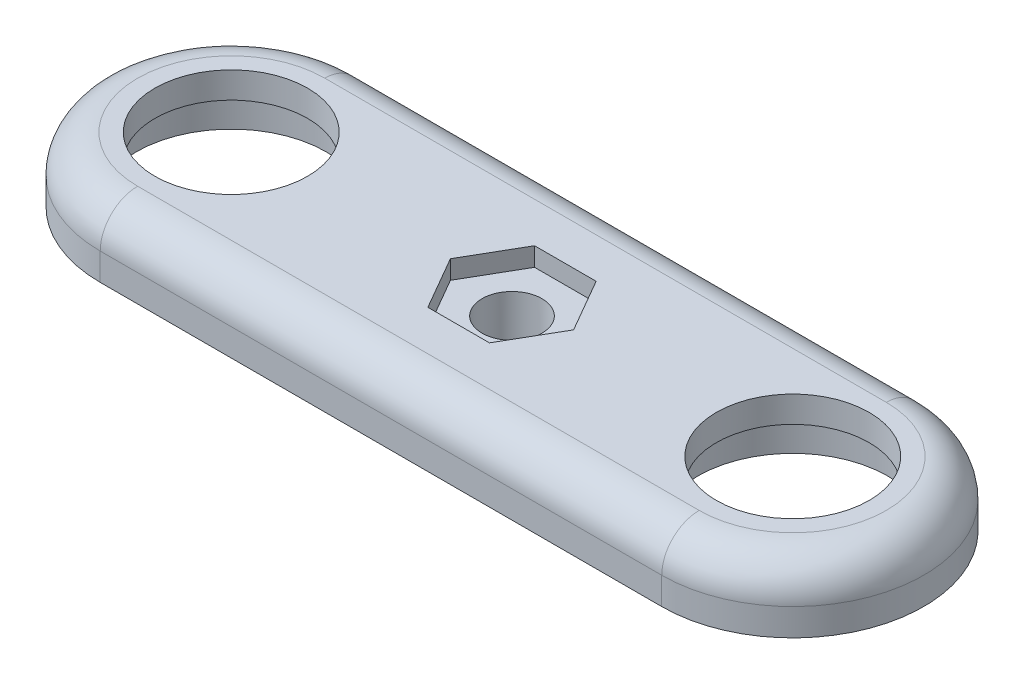
ISO-10303-21;
HEADER;
FILE_DESCRIPTION(('STEP AP214'),'2;1');
FILE_NAME('part.step','',(''),(''),'','','');
FILE_SCHEMA(('AUTOMOTIVE_DESIGN { 1 0 10303 214 1 1 1 1 }'));
ENDSEC;
DATA;
#1=APPLICATION_CONTEXT('core data for automotive mechanical design processes');
#2=APPLICATION_PROTOCOL_DEFINITION('international standard','automotive_design',2000,#1);
#3=PRODUCT_CONTEXT('',#1,'mechanical');
#4=PRODUCT('Part','Part','',(#3));
#5=PRODUCT_RELATED_PRODUCT_CATEGORY('part','',(#4));
#6=PRODUCT_DEFINITION_FORMATION('','',#4);
#7=PRODUCT_DEFINITION_CONTEXT('part definition',#1,'design');
#8=PRODUCT_DEFINITION('design','',#6,#7);
#9=PRODUCT_DEFINITION_SHAPE('','',#8);
#10=(LENGTH_UNIT() NAMED_UNIT(*) SI_UNIT(.MILLI.,.METRE.));
#11=(NAMED_UNIT(*) PLANE_ANGLE_UNIT() SI_UNIT($,.RADIAN.));
#12=(NAMED_UNIT(*) SI_UNIT($,.STERADIAN.) SOLID_ANGLE_UNIT());
#13=UNCERTAINTY_MEASURE_WITH_UNIT(LENGTH_MEASURE(1.E-05),#10,'distance_accuracy_value','');
#14=(GEOMETRIC_REPRESENTATION_CONTEXT(3) GLOBAL_UNCERTAINTY_ASSIGNED_CONTEXT((#13)) GLOBAL_UNIT_ASSIGNED_CONTEXT((#10,
#11,#12)) REPRESENTATION_CONTEXT('',''));
#15=CARTESIAN_POINT('',(0.,0.,0.));
#16=DIRECTION('',(0.,0.,1.));
#17=DIRECTION('',(1.,0.,0.));
#18=AXIS2_PLACEMENT_3D('',#15,#16,#17);
#19=CARTESIAN_POINT('',(-15.,3.45,0.));
#20=DIRECTION('',(0.,-1.,0.));
#21=DIRECTION('',(0.,0.,-1.));
#22=AXIS2_PLACEMENT_3D('',#19,#20,#21);
#23=CYLINDRICAL_SURFACE('',#22,4.08);
#24=CARTESIAN_POINT('',(-15.,3.45,0.));
#25=DIRECTION('',(0.,1.,0.));
#26=DIRECTION('',(0.,0.,1.));
#27=AXIS2_PLACEMENT_3D('',#24,#25,#26);
#28=CIRCLE('',#27,4.08);
#29=CARTESIAN_POINT('',(-15.,3.45,4.08));
#30=VERTEX_POINT('',#29);
#31=EDGE_CURVE('E168',#30,#30,#28,.T.);
#32=ORIENTED_EDGE('',*,*,#31,.T.);
#33=EDGE_LOOP('',(#32));
#34=FACE_BOUND('',#33,.T.);
#35=CARTESIAN_POINT('',(-15.,2.05,0.));
#36=DIRECTION('',(0.,-1.,0.));
#37=DIRECTION('',(0.,0.,-1.));
#38=AXIS2_PLACEMENT_3D('',#35,#36,#37);
#39=CIRCLE('',#38,4.08);
#40=CARTESIAN_POINT('',(-15.,2.05,-4.08));
#41=VERTEX_POINT('',#40);
#42=EDGE_CURVE('E195',#41,#41,#39,.T.);
#43=ORIENTED_EDGE('',*,*,#42,.T.);
#44=EDGE_LOOP('',(#43));
#45=FACE_BOUND('',#44,.T.);
#46=ADVANCED_FACE('F38',(#34,#45),#23,.F.);
#47=CARTESIAN_POINT('',(15.,3.45,0.));
#48=DIRECTION('',(0.,-1.,0.));
#49=DIRECTION('',(0.,0.,-1.));
#50=AXIS2_PLACEMENT_3D('',#47,#48,#49);
#51=CYLINDRICAL_SURFACE('',#50,4.08);
#52=CARTESIAN_POINT('',(15.,3.45,0.));
#53=DIRECTION('',(0.,1.,0.));
#54=DIRECTION('',(0.,0.,1.));
#55=AXIS2_PLACEMENT_3D('',#52,#53,#54);
#56=CIRCLE('',#55,4.08);
#57=CARTESIAN_POINT('',(15.,3.45,4.08));
#58=VERTEX_POINT('',#57);
#59=EDGE_CURVE('E165',#58,#58,#56,.T.);
#60=ORIENTED_EDGE('',*,*,#59,.T.);
#61=EDGE_LOOP('',(#60));
#62=FACE_BOUND('',#61,.T.);
#63=CARTESIAN_POINT('',(15.,2.05,0.));
#64=DIRECTION('',(0.,-1.,0.));
#65=DIRECTION('',(0.,0.,-1.));
#66=AXIS2_PLACEMENT_3D('',#63,#64,#65);
#67=CIRCLE('',#66,4.08);
#68=CARTESIAN_POINT('',(15.,2.05,-4.08));
#69=VERTEX_POINT('',#68);
#70=EDGE_CURVE('E192',#69,#69,#67,.T.);
#71=ORIENTED_EDGE('',*,*,#70,.T.);
#72=EDGE_LOOP('',(#71));
#73=FACE_BOUND('',#72,.T.);
#74=ADVANCED_FACE('F289',(#62,#73),#51,.F.);
#75=CARTESIAN_POINT('',(-15.,3.45,0.));
#76=DIRECTION('',(0.,1.,0.));
#77=DIRECTION('',(0.,0.,1.));
#78=AXIS2_PLACEMENT_3D('',#75,#76,#77);
#79=PLANE('',#78);
#80=CARTESIAN_POINT('',(15.,3.45,0.));
#81=DIRECTION('',(0.,1.,0.));
#82=DIRECTION('',(0.,0.,1.));
#83=AXIS2_PLACEMENT_3D('',#80,#81,#82);
#84=CIRCLE('',#83,5.);
#85=CARTESIAN_POINT('',(15.,3.45,5.));
#86=VERTEX_POINT('',#85);
#87=CARTESIAN_POINT('',(15.,3.45,-5.));
#88=VERTEX_POINT('',#87);
#89=EDGE_CURVE('E203',#86,#88,#84,.T.);
#90=ORIENTED_EDGE('',*,*,#89,.T.);
#91=DIRECTION('',(-1.,0.,0.));
#92=VECTOR('',#91,1.);
#93=CARTESIAN_POINT('',(-15.,3.45,-5.));
#94=LINE('',#93,#92);
#95=CARTESIAN_POINT('',(-15.,3.45,-5.));
#96=VERTEX_POINT('',#95);
#97=EDGE_CURVE('E205',#88,#96,#94,.T.);
#98=ORIENTED_EDGE('',*,*,#97,.T.);
#99=CARTESIAN_POINT('',(-15.,3.45,0.));
#100=DIRECTION('',(0.,1.,0.));
#101=DIRECTION('',(0.,0.,1.));
#102=AXIS2_PLACEMENT_3D('',#99,#100,#101);
#103=CIRCLE('',#102,5.);
#104=CARTESIAN_POINT('',(-15.,3.45,5.));
#105=VERTEX_POINT('',#104);
#106=EDGE_CURVE('E190',#96,#105,#103,.T.);
#107=ORIENTED_EDGE('',*,*,#106,.T.);
#108=DIRECTION('',(1.,0.,0.));
#109=VECTOR('',#108,1.);
#110=CARTESIAN_POINT('',(15.,3.45,5.));
#111=LINE('',#110,#109);
#112=EDGE_CURVE('E201',#105,#86,#111,.T.);
#113=ORIENTED_EDGE('',*,*,#112,.T.);
#114=EDGE_LOOP('',(#90,#98,#107,#113));
#115=FACE_BOUND('',#114,.T.);
#116=ORIENTED_EDGE('',*,*,#59,.F.);
#117=EDGE_LOOP('',(#116));
#118=FACE_BOUND('',#117,.T.);
#119=ORIENTED_EDGE('',*,*,#31,.F.);
#120=EDGE_LOOP('',(#119));
#121=FACE_BOUND('',#120,.T.);
#122=DIRECTION('',(-0.499999999999998,0.,-0.86602540378444));
#123=VECTOR('',#122,1.);
#124=CARTESIAN_POINT('',(-1.64544826719044,3.45,2.85));
#125=LINE('',#124,#123);
#126=CARTESIAN_POINT('',(-1.64544826719044,3.45,2.85));
#127=VERTEX_POINT('',#126);
#128=CARTESIAN_POINT('',(-3.29089653438086,3.45,0.));
#129=VERTEX_POINT('',#128);
#130=EDGE_CURVE('E148',#127,#129,#125,.T.);
#131=ORIENTED_EDGE('',*,*,#130,.T.);
#132=DIRECTION('',(0.499999999999998,0.,-0.86602540378444));
#133=VECTOR('',#132,1.);
#134=CARTESIAN_POINT('',(-3.29089653438086,3.45,0.));
#135=LINE('',#134,#133);
#136=CARTESIAN_POINT('',(-1.64544826719044,3.45,-2.85));
#137=VERTEX_POINT('',#136);
#138=EDGE_CURVE('E199',#129,#137,#135,.T.);
#139=ORIENTED_EDGE('',*,*,#138,.T.);
#140=DIRECTION('',(1.,0.,0.));
#141=VECTOR('',#140,1.);
#142=CARTESIAN_POINT('',(-1.64544826719044,3.45,-2.85));
#143=LINE('',#142,#141);
#144=CARTESIAN_POINT('',(1.64544826719044,3.45,-2.85));
#145=VERTEX_POINT('',#144);
#146=EDGE_CURVE('E152',#137,#145,#143,.T.);
#147=ORIENTED_EDGE('',*,*,#146,.T.);
#148=DIRECTION('',(0.499999999999998,0.,0.86602540378444));
#149=VECTOR('',#148,1.);
#150=CARTESIAN_POINT('',(1.64544826719044,3.45,-2.85));
#151=LINE('',#150,#149);
#152=CARTESIAN_POINT('',(3.29089653438086,3.45,0.));
#153=VERTEX_POINT('',#152);
#154=EDGE_CURVE('E246',#145,#153,#151,.T.);
#155=ORIENTED_EDGE('',*,*,#154,.T.);
#156=DIRECTION('',(-0.499999999999998,0.,0.86602540378444));
#157=VECTOR('',#156,1.);
#158=CARTESIAN_POINT('',(3.29089653438086,3.45,0.));
#159=LINE('',#158,#157);
#160=CARTESIAN_POINT('',(1.64544826719044,3.45,2.85));
#161=VERTEX_POINT('',#160);
#162=EDGE_CURVE('E249',#153,#161,#159,.T.);
#163=ORIENTED_EDGE('',*,*,#162,.T.);
#164=DIRECTION('',(-1.,0.,0.));
#165=VECTOR('',#164,1.);
#166=CARTESIAN_POINT('',(1.64544826719044,3.45,2.85));
#167=LINE('',#166,#165);
#168=EDGE_CURVE('E252',#161,#127,#167,.T.);
#169=ORIENTED_EDGE('',*,*,#168,.T.);
#170=EDGE_LOOP('',(#131,#139,#147,#155,#163,#169));
#171=FACE_BOUND('',#170,.T.);
#172=ADVANCED_FACE('F271',(#115,#118,#121,#171),#79,.T.);
#173=CARTESIAN_POINT('',(-15.,0.,0.));
#174=DIRECTION('',(0.,1.,0.));
#175=DIRECTION('',(0.,0.,1.));
#176=AXIS2_PLACEMENT_3D('',#173,#174,#175);
#177=PLANE('',#176);
#178=CARTESIAN_POINT('',(-15.,0.,0.));
#179=DIRECTION('',(0.,-1.,0.));
#180=DIRECTION('',(0.,0.,-1.));
#181=AXIS2_PLACEMENT_3D('',#178,#179,#180);
#182=CIRCLE('',#181,5.08);
#183=CARTESIAN_POINT('',(-15.,0.,-5.08));
#184=VERTEX_POINT('',#183);
#185=EDGE_CURVE('E233',#184,#184,#182,.T.);
#186=ORIENTED_EDGE('',*,*,#185,.F.);
#187=EDGE_LOOP('',(#186));
#188=FACE_BOUND('',#187,.T.);
#189=CARTESIAN_POINT('',(15.,0.,0.));
#190=DIRECTION('',(0.,-1.,0.));
#191=DIRECTION('',(0.,0.,-1.));
#192=AXIS2_PLACEMENT_3D('',#189,#190,#191);
#193=CIRCLE('',#192,5.08);
#194=CARTESIAN_POINT('',(15.,0.,-5.08));
#195=VERTEX_POINT('',#194);
#196=EDGE_CURVE('E228',#195,#195,#193,.T.);
#197=ORIENTED_EDGE('',*,*,#196,.F.);
#198=EDGE_LOOP('',(#197));
#199=FACE_BOUND('',#198,.T.);
#200=CARTESIAN_POINT('',(0.,0.,0.));
#201=DIRECTION('',(0.,1.,0.));
#202=DIRECTION('',(0.,0.,1.));
#203=AXIS2_PLACEMENT_3D('',#200,#201,#202);
#204=CIRCLE('',#203,1.6);
#205=CARTESIAN_POINT('',(0.,0.,1.6));
#206=VERTEX_POINT('',#205);
#207=EDGE_CURVE('E157',#206,#206,#204,.T.);
#208=ORIENTED_EDGE('',*,*,#207,.T.);
#209=EDGE_LOOP('',(#208));
#210=FACE_BOUND('',#209,.T.);
#211=CARTESIAN_POINT('',(-15.,0.,0.));
#212=DIRECTION('',(0.,1.,0.));
#213=DIRECTION('',(0.,0.,1.));
#214=AXIS2_PLACEMENT_3D('',#211,#212,#213);
#215=CIRCLE('',#214,7.);
#216=CARTESIAN_POINT('',(-15.,0.,-7.));
#217=VERTEX_POINT('',#216);
#218=CARTESIAN_POINT('',(-15.,0.,7.));
#219=VERTEX_POINT('',#218);
#220=EDGE_CURVE('E171',#217,#219,#215,.T.);
#221=ORIENTED_EDGE('',*,*,#220,.F.);
#222=DIRECTION('',(-1.,0.,0.));
#223=VECTOR('',#222,1.);
#224=CARTESIAN_POINT('',(-15.,0.,-7.));
#225=LINE('',#224,#223);
#226=CARTESIAN_POINT('',(15.,0.,-7.));
#227=VERTEX_POINT('',#226);
#228=EDGE_CURVE('E180',#227,#217,#225,.T.);
#229=ORIENTED_EDGE('',*,*,#228,.F.);
#230=CARTESIAN_POINT('',(15.,0.,0.));
#231=DIRECTION('',(0.,1.,0.));
#232=DIRECTION('',(0.,0.,1.));
#233=AXIS2_PLACEMENT_3D('',#230,#231,#232);
#234=CIRCLE('',#233,7.);
#235=CARTESIAN_POINT('',(15.,0.,7.));
#236=VERTEX_POINT('',#235);
#237=EDGE_CURVE('E177',#236,#227,#234,.T.);
#238=ORIENTED_EDGE('',*,*,#237,.F.);
#239=DIRECTION('',(1.,0.,0.));
#240=VECTOR('',#239,1.);
#241=CARTESIAN_POINT('',(-15.,0.,7.));
#242=LINE('',#241,#240);
#243=EDGE_CURVE('E174',#219,#236,#242,.T.);
#244=ORIENTED_EDGE('',*,*,#243,.F.);
#245=EDGE_LOOP('',(#221,#229,#238,#244));
#246=FACE_BOUND('',#245,.T.);
#247=ADVANCED_FACE('F302',(#188,#199,#210,#246),#177,.F.);
#248=CARTESIAN_POINT('',(-15.,3.45,0.));
#249=DIRECTION('',(0.,-1.,0.));
#250=DIRECTION('',(0.,0.,-1.));
#251=AXIS2_PLACEMENT_3D('',#248,#249,#250);
#252=CYLINDRICAL_SURFACE('',#251,7.);
#253=DIRECTION('',(0.,-1.,0.));
#254=VECTOR('',#253,1.);
#255=CARTESIAN_POINT('',(-15.,3.45,7.));
#256=LINE('',#255,#254);
#257=CARTESIAN_POINT('',(-15.,1.45,7.));
#258=VERTEX_POINT('',#257);
#259=EDGE_CURVE('E189',#258,#219,#256,.T.);
#260=ORIENTED_EDGE('',*,*,#259,.F.);
#261=CARTESIAN_POINT('',(-15.,1.45,0.));
#262=DIRECTION('',(0.,1.,0.));
#263=DIRECTION('',(0.,0.,1.));
#264=AXIS2_PLACEMENT_3D('',#261,#262,#263);
#265=CIRCLE('',#264,7.);
#266=CARTESIAN_POINT('',(-15.,1.45,-7.));
#267=VERTEX_POINT('',#266);
#268=EDGE_CURVE('E11',#258,#267,#265,.F.);
#269=ORIENTED_EDGE('',*,*,#268,.T.);
#270=DIRECTION('',(0.,-1.,0.));
#271=VECTOR('',#270,1.);
#272=CARTESIAN_POINT('',(-15.,3.45,-7.));
#273=LINE('',#272,#271);
#274=EDGE_CURVE('E183',#267,#217,#273,.T.);
#275=ORIENTED_EDGE('',*,*,#274,.T.);
#276=ORIENTED_EDGE('',*,*,#220,.T.);
#277=EDGE_LOOP('',(#260,#269,#275,#276));
#278=FACE_BOUND('',#277,.T.);
#279=ADVANCED_FACE('F306',(#278),#252,.T.);
#280=CARTESIAN_POINT('',(-15.,3.45,7.));
#281=DIRECTION('',(0.,0.,-1.));
#282=DIRECTION('',(-1.,0.,0.));
#283=AXIS2_PLACEMENT_3D('',#280,#281,#282);
#284=PLANE('',#283);
#285=DIRECTION('',(0.,-1.,0.));
#286=VECTOR('',#285,1.);
#287=CARTESIAN_POINT('',(15.,3.45,7.));
#288=LINE('',#287,#286);
#289=CARTESIAN_POINT('',(15.,1.45,7.));
#290=VERTEX_POINT('',#289);
#291=EDGE_CURVE('E187',#290,#236,#288,.T.);
#292=ORIENTED_EDGE('',*,*,#291,.F.);
#293=DIRECTION('',(1.,0.,0.));
#294=VECTOR('',#293,1.);
#295=CARTESIAN_POINT('',(-15.,1.45,7.));
#296=LINE('',#295,#294);
#297=EDGE_CURVE('E47',#290,#258,#296,.F.);
#298=ORIENTED_EDGE('',*,*,#297,.T.);
#299=ORIENTED_EDGE('',*,*,#259,.T.);
#300=ORIENTED_EDGE('',*,*,#243,.T.);
#301=EDGE_LOOP('',(#292,#298,#299,#300));
#302=FACE_BOUND('',#301,.T.);
#303=ADVANCED_FACE('F316',(#302),#284,.F.);
#304=CARTESIAN_POINT('',(15.,3.45,0.));
#305=DIRECTION('',(0.,-1.,0.));
#306=DIRECTION('',(0.,0.,-1.));
#307=AXIS2_PLACEMENT_3D('',#304,#305,#306);
#308=CYLINDRICAL_SURFACE('',#307,7.);
#309=DIRECTION('',(0.,-1.,0.));
#310=VECTOR('',#309,1.);
#311=CARTESIAN_POINT('',(15.,3.45,-7.));
#312=LINE('',#311,#310);
#313=CARTESIAN_POINT('',(15.,1.45,-7.));
#314=VERTEX_POINT('',#313);
#315=EDGE_CURVE('E185',#314,#227,#312,.T.);
#316=ORIENTED_EDGE('',*,*,#315,.F.);
#317=CARTESIAN_POINT('',(15.,1.45,0.));
#318=DIRECTION('',(0.,1.,0.));
#319=DIRECTION('',(0.,0.,1.));
#320=AXIS2_PLACEMENT_3D('',#317,#318,#319);
#321=CIRCLE('',#320,7.);
#322=EDGE_CURVE('E62',#314,#290,#321,.F.);
#323=ORIENTED_EDGE('',*,*,#322,.T.);
#324=ORIENTED_EDGE('',*,*,#291,.T.);
#325=ORIENTED_EDGE('',*,*,#237,.T.);
#326=EDGE_LOOP('',(#316,#323,#324,#325));
#327=FACE_BOUND('',#326,.T.);
#328=ADVANCED_FACE('F312',(#327),#308,.T.);
#329=CARTESIAN_POINT('',(-15.,3.45,-7.));
#330=DIRECTION('',(0.,0.,1.));
#331=DIRECTION('',(1.,0.,0.));
#332=AXIS2_PLACEMENT_3D('',#329,#330,#331);
#333=PLANE('',#332);
#334=ORIENTED_EDGE('',*,*,#274,.F.);
#335=DIRECTION('',(-1.,0.,0.));
#336=VECTOR('',#335,1.);
#337=CARTESIAN_POINT('',(15.,1.45,-7.));
#338=LINE('',#337,#336);
#339=EDGE_CURVE('E208',#267,#314,#338,.F.);
#340=ORIENTED_EDGE('',*,*,#339,.T.);
#341=ORIENTED_EDGE('',*,*,#315,.T.);
#342=ORIENTED_EDGE('',*,*,#228,.T.);
#343=EDGE_LOOP('',(#334,#340,#341,#342));
#344=FACE_BOUND('',#343,.T.);
#345=ADVANCED_FACE('F308',(#344),#333,.F.);
#346=CARTESIAN_POINT('',(0.,0.,0.));
#347=DIRECTION('',(0.,1.,0.));
#348=DIRECTION('',(0.,0.,1.));
#349=AXIS2_PLACEMENT_3D('',#346,#347,#348);
#350=CYLINDRICAL_SURFACE('',#349,1.6);
#351=CARTESIAN_POINT('',(0.,2.45,0.));
#352=DIRECTION('',(0.,-1.,0.));
#353=DIRECTION('',(0.,0.,-1.));
#354=AXIS2_PLACEMENT_3D('',#351,#352,#353);
#355=CIRCLE('',#354,1.6);
#356=CARTESIAN_POINT('',(0.,2.45,-1.6));
#357=VERTEX_POINT('',#356);
#358=EDGE_CURVE('E153',#357,#357,#355,.F.);
#359=ORIENTED_EDGE('',*,*,#358,.T.);
#360=EDGE_LOOP('',(#359));
#361=FACE_BOUND('',#360,.T.);
#362=ORIENTED_EDGE('',*,*,#207,.F.);
#363=EDGE_LOOP('',(#362));
#364=FACE_BOUND('',#363,.T.);
#365=ADVANCED_FACE('F311',(#361,#364),#350,.F.);
#366=CARTESIAN_POINT('',(0.,2.45,0.));
#367=DIRECTION('',(0.,-1.,0.));
#368=DIRECTION('',(0.,0.,-1.));
#369=AXIS2_PLACEMENT_3D('',#366,#367,#368);
#370=PLANE('',#369);
#371=DIRECTION('',(0.499999999999998,0.,-0.86602540378444));
#372=VECTOR('',#371,1.);
#373=CARTESIAN_POINT('',(-3.29089653438086,2.45,0.));
#374=LINE('',#373,#372);
#375=CARTESIAN_POINT('',(-3.29089653438086,2.45,0.));
#376=VERTEX_POINT('',#375);
#377=CARTESIAN_POINT('',(-1.64544826719044,2.45,-2.85));
#378=VERTEX_POINT('',#377);
#379=EDGE_CURVE('E133',#376,#378,#374,.T.);
#380=ORIENTED_EDGE('',*,*,#379,.F.);
#381=DIRECTION('',(-0.499999999999998,0.,-0.86602540378444));
#382=VECTOR('',#381,1.);
#383=CARTESIAN_POINT('',(-1.64544826719044,2.45,2.85));
#384=LINE('',#383,#382);
#385=CARTESIAN_POINT('',(-1.64544826719044,2.45,2.85));
#386=VERTEX_POINT('',#385);
#387=EDGE_CURVE('E242',#386,#376,#384,.T.);
#388=ORIENTED_EDGE('',*,*,#387,.F.);
#389=DIRECTION('',(-1.,0.,0.));
#390=VECTOR('',#389,1.);
#391=CARTESIAN_POINT('',(1.64544826719044,2.45,2.85));
#392=LINE('',#391,#390);
#393=CARTESIAN_POINT('',(1.64544826719044,2.45,2.85));
#394=VERTEX_POINT('',#393);
#395=EDGE_CURVE('E240',#394,#386,#392,.T.);
#396=ORIENTED_EDGE('',*,*,#395,.F.);
#397=DIRECTION('',(-0.499999999999998,0.,0.86602540378444));
#398=VECTOR('',#397,1.);
#399=CARTESIAN_POINT('',(3.29089653438086,2.45,0.));
#400=LINE('',#399,#398);
#401=CARTESIAN_POINT('',(3.29089653438086,2.45,0.));
#402=VERTEX_POINT('',#401);
#403=EDGE_CURVE('E238',#402,#394,#400,.T.);
#404=ORIENTED_EDGE('',*,*,#403,.F.);
#405=DIRECTION('',(0.499999999999998,0.,0.86602540378444));
#406=VECTOR('',#405,1.);
#407=CARTESIAN_POINT('',(1.64544826719044,2.45,-2.85));
#408=LINE('',#407,#406);
#409=CARTESIAN_POINT('',(1.64544826719044,2.45,-2.85));
#410=VERTEX_POINT('',#409);
#411=EDGE_CURVE('E135',#410,#402,#408,.T.);
#412=ORIENTED_EDGE('',*,*,#411,.F.);
#413=DIRECTION('',(1.,0.,0.));
#414=VECTOR('',#413,1.);
#415=CARTESIAN_POINT('',(-1.64544826719044,2.45,-2.85));
#416=LINE('',#415,#414);
#417=EDGE_CURVE('E128',#378,#410,#416,.T.);
#418=ORIENTED_EDGE('',*,*,#417,.F.);
#419=EDGE_LOOP('',(#380,#388,#396,#404,#412,#418));
#420=FACE_BOUND('',#419,.T.);
#421=ORIENTED_EDGE('',*,*,#358,.F.);
#422=EDGE_LOOP('',(#421));
#423=FACE_BOUND('',#422,.T.);
#424=ADVANCED_FACE('F130',(#420,#423),#370,.F.);
#425=CARTESIAN_POINT('',(-3.29089653438086,2.45,0.));
#426=DIRECTION('',(0.86602540378444,0.,0.499999999999998));
#427=DIRECTION('',(0.499999999999998,0.,-0.86602540378444));
#428=AXIS2_PLACEMENT_3D('',#425,#426,#427);
#429=PLANE('',#428);
#430=ORIENTED_EDGE('',*,*,#138,.F.);
#431=DIRECTION('',(0.,1.,0.));
#432=VECTOR('',#431,1.);
#433=CARTESIAN_POINT('',(-3.29089653438086,2.45,0.));
#434=LINE('',#433,#432);
#435=EDGE_CURVE('E147',#376,#129,#434,.T.);
#436=ORIENTED_EDGE('',*,*,#435,.F.);
#437=ORIENTED_EDGE('',*,*,#379,.T.);
#438=DIRECTION('',(0.,1.,0.));
#439=VECTOR('',#438,1.);
#440=CARTESIAN_POINT('',(-1.64544826719044,2.45,-2.85));
#441=LINE('',#440,#439);
#442=EDGE_CURVE('E144',#378,#137,#441,.T.);
#443=ORIENTED_EDGE('',*,*,#442,.T.);
#444=EDGE_LOOP('',(#430,#436,#437,#443));
#445=FACE_BOUND('',#444,.T.);
#446=ADVANCED_FACE('F143',(#445),#429,.T.);
#447=CARTESIAN_POINT('',(-1.64544826719044,2.45,-2.85));
#448=DIRECTION('',(0.,0.,1.));
#449=DIRECTION('',(1.,0.,0.));
#450=AXIS2_PLACEMENT_3D('',#447,#448,#449);
#451=PLANE('',#450);
#452=ORIENTED_EDGE('',*,*,#146,.F.);
#453=ORIENTED_EDGE('',*,*,#442,.F.);
#454=ORIENTED_EDGE('',*,*,#417,.T.);
#455=DIRECTION('',(0.,1.,0.));
#456=VECTOR('',#455,1.);
#457=CARTESIAN_POINT('',(1.64544826719044,2.45,-2.85));
#458=LINE('',#457,#456);
#459=EDGE_CURVE('E154',#410,#145,#458,.T.);
#460=ORIENTED_EDGE('',*,*,#459,.T.);
#461=EDGE_LOOP('',(#452,#453,#454,#460));
#462=FACE_BOUND('',#461,.T.);
#463=ADVANCED_FACE('F150',(#462),#451,.T.);
#464=CARTESIAN_POINT('',(1.64544826719044,2.45,-2.85));
#465=DIRECTION('',(-0.86602540378444,0.,0.499999999999998));
#466=DIRECTION('',(0.499999999999998,0.,0.86602540378444));
#467=AXIS2_PLACEMENT_3D('',#464,#465,#466);
#468=PLANE('',#467);
#469=ORIENTED_EDGE('',*,*,#154,.F.);
#470=ORIENTED_EDGE('',*,*,#459,.F.);
#471=ORIENTED_EDGE('',*,*,#411,.T.);
#472=DIRECTION('',(0.,1.,0.));
#473=VECTOR('',#472,1.);
#474=CARTESIAN_POINT('',(3.29089653438086,2.45,0.));
#475=LINE('',#474,#473);
#476=EDGE_CURVE('E159',#402,#153,#475,.T.);
#477=ORIENTED_EDGE('',*,*,#476,.T.);
#478=EDGE_LOOP('',(#469,#470,#471,#477));
#479=FACE_BOUND('',#478,.T.);
#480=ADVANCED_FACE('F265',(#479),#468,.T.);
#481=CARTESIAN_POINT('',(3.29089653438086,2.45,0.));
#482=DIRECTION('',(-0.86602540378444,0.,-0.499999999999998));
#483=DIRECTION('',(-0.499999999999998,0.,0.86602540378444));
#484=AXIS2_PLACEMENT_3D('',#481,#482,#483);
#485=PLANE('',#484);
#486=ORIENTED_EDGE('',*,*,#162,.F.);
#487=ORIENTED_EDGE('',*,*,#476,.F.);
#488=ORIENTED_EDGE('',*,*,#403,.T.);
#489=DIRECTION('',(0.,1.,0.));
#490=VECTOR('',#489,1.);
#491=CARTESIAN_POINT('',(1.64544826719044,2.45,2.85));
#492=LINE('',#491,#490);
#493=EDGE_CURVE('E260',#394,#161,#492,.T.);
#494=ORIENTED_EDGE('',*,*,#493,.T.);
#495=EDGE_LOOP('',(#486,#487,#488,#494));
#496=FACE_BOUND('',#495,.T.);
#497=ADVANCED_FACE('F267',(#496),#485,.T.);
#498=CARTESIAN_POINT('',(1.64544826719044,2.45,2.85));
#499=DIRECTION('',(0.,0.,-1.));
#500=DIRECTION('',(-1.,0.,0.));
#501=AXIS2_PLACEMENT_3D('',#498,#499,#500);
#502=PLANE('',#501);
#503=ORIENTED_EDGE('',*,*,#168,.F.);
#504=ORIENTED_EDGE('',*,*,#493,.F.);
#505=ORIENTED_EDGE('',*,*,#395,.T.);
#506=DIRECTION('',(0.,1.,0.));
#507=VECTOR('',#506,1.);
#508=CARTESIAN_POINT('',(-1.64544826719044,2.45,2.85));
#509=LINE('',#508,#507);
#510=EDGE_CURVE('E258',#386,#127,#509,.T.);
#511=ORIENTED_EDGE('',*,*,#510,.T.);
#512=EDGE_LOOP('',(#503,#504,#505,#511));
#513=FACE_BOUND('',#512,.T.);
#514=ADVANCED_FACE('F278',(#513),#502,.T.);
#515=CARTESIAN_POINT('',(-1.64544826719044,2.45,2.85));
#516=DIRECTION('',(0.86602540378444,0.,-0.499999999999998));
#517=DIRECTION('',(-0.499999999999998,0.,-0.86602540378444));
#518=AXIS2_PLACEMENT_3D('',#515,#516,#517);
#519=PLANE('',#518);
#520=ORIENTED_EDGE('',*,*,#130,.F.);
#521=ORIENTED_EDGE('',*,*,#510,.F.);
#522=ORIENTED_EDGE('',*,*,#387,.T.);
#523=ORIENTED_EDGE('',*,*,#435,.T.);
#524=EDGE_LOOP('',(#520,#521,#522,#523));
#525=FACE_BOUND('',#524,.T.);
#526=ADVANCED_FACE('F274',(#525),#519,.T.);
#527=CARTESIAN_POINT('',(15.,2.05,0.));
#528=DIRECTION('',(0.,-1.,0.));
#529=DIRECTION('',(0.,0.,-1.));
#530=AXIS2_PLACEMENT_3D('',#527,#528,#529);
#531=CYLINDRICAL_SURFACE('',#530,5.08);
#532=CARTESIAN_POINT('',(15.,2.05,0.));
#533=DIRECTION('',(0.,-1.,0.));
#534=DIRECTION('',(0.,0.,-1.));
#535=AXIS2_PLACEMENT_3D('',#532,#533,#534);
#536=CIRCLE('',#535,5.08);
#537=CARTESIAN_POINT('',(15.,2.05,-5.08));
#538=VERTEX_POINT('',#537);
#539=EDGE_CURVE('E223',#538,#538,#536,.T.);
#540=ORIENTED_EDGE('',*,*,#539,.F.);
#541=EDGE_LOOP('',(#540));
#542=FACE_BOUND('',#541,.T.);
#543=ORIENTED_EDGE('',*,*,#196,.T.);
#544=EDGE_LOOP('',(#543));
#545=FACE_BOUND('',#544,.T.);
#546=ADVANCED_FACE('F285',(#542,#545),#531,.F.);
#547=CARTESIAN_POINT('',(15.,2.05,0.));
#548=DIRECTION('',(0.,-1.,0.));
#549=DIRECTION('',(0.,0.,-1.));
#550=AXIS2_PLACEMENT_3D('',#547,#548,#549);
#551=PLANE('',#550);
#552=ORIENTED_EDGE('',*,*,#70,.F.);
#553=EDGE_LOOP('',(#552));
#554=FACE_BOUND('',#553,.T.);
#555=ORIENTED_EDGE('',*,*,#539,.T.);
#556=EDGE_LOOP('',(#555));
#557=FACE_BOUND('',#556,.T.);
#558=ADVANCED_FACE('F356',(#554,#557),#551,.T.);
#559=CARTESIAN_POINT('',(-15.,2.05,0.));
#560=DIRECTION('',(0.,-1.,0.));
#561=DIRECTION('',(0.,0.,-1.));
#562=AXIS2_PLACEMENT_3D('',#559,#560,#561);
#563=CYLINDRICAL_SURFACE('',#562,5.08);
#564=CARTESIAN_POINT('',(-15.,2.05,0.));
#565=DIRECTION('',(0.,-1.,0.));
#566=DIRECTION('',(0.,0.,-1.));
#567=AXIS2_PLACEMENT_3D('',#564,#565,#566);
#568=CIRCLE('',#567,5.08);
#569=CARTESIAN_POINT('',(-15.,2.05,-5.08));
#570=VERTEX_POINT('',#569);
#571=EDGE_CURVE('E196',#570,#570,#568,.T.);
#572=ORIENTED_EDGE('',*,*,#571,.F.);
#573=EDGE_LOOP('',(#572));
#574=FACE_BOUND('',#573,.T.);
#575=ORIENTED_EDGE('',*,*,#185,.T.);
#576=EDGE_LOOP('',(#575));
#577=FACE_BOUND('',#576,.T.);
#578=ADVANCED_FACE('F338',(#574,#577),#563,.F.);
#579=CARTESIAN_POINT('',(-15.,2.05,0.));
#580=DIRECTION('',(0.,-1.,0.));
#581=DIRECTION('',(0.,0.,-1.));
#582=AXIS2_PLACEMENT_3D('',#579,#580,#581);
#583=PLANE('',#582);
#584=ORIENTED_EDGE('',*,*,#42,.F.);
#585=EDGE_LOOP('',(#584));
#586=FACE_BOUND('',#585,.T.);
#587=ORIENTED_EDGE('',*,*,#571,.T.);
#588=EDGE_LOOP('',(#587));
#589=FACE_BOUND('',#588,.T.);
#590=ADVANCED_FACE('F333',(#586,#589),#583,.T.);
#591=CARTESIAN_POINT('',(-15.,1.45,5.));
#592=DIRECTION('',(-1.,0.,0.));
#593=DIRECTION('',(0.,0.,1.));
#594=AXIS2_PLACEMENT_3D('',#591,#592,#593);
#595=CYLINDRICAL_SURFACE('',#594,2.);
#596=CARTESIAN_POINT('',(-15.,1.45,5.));
#597=DIRECTION('',(-1.,0.,0.));
#598=DIRECTION('',(0.,0.,1.));
#599=AXIS2_PLACEMENT_3D('',#596,#597,#598);
#600=CIRCLE('',#599,2.);
#601=EDGE_CURVE('E216',#258,#105,#600,.T.);
#602=ORIENTED_EDGE('',*,*,#601,.F.);
#603=ORIENTED_EDGE('',*,*,#297,.F.);
#604=CARTESIAN_POINT('',(15.,1.45,5.));
#605=DIRECTION('',(1.,0.,0.));
#606=DIRECTION('',(0.,0.,-1.));
#607=AXIS2_PLACEMENT_3D('',#604,#605,#606);
#608=CIRCLE('',#607,2.);
#609=EDGE_CURVE('E42',#86,#290,#608,.T.);
#610=ORIENTED_EDGE('',*,*,#609,.F.);
#611=ORIENTED_EDGE('',*,*,#112,.F.);
#612=EDGE_LOOP('',(#602,#603,#610,#611));
#613=FACE_BOUND('',#612,.T.);
#614=ADVANCED_FACE('F40',(#613),#595,.T.);
#615=CARTESIAN_POINT('',(15.,1.45,0.));
#616=DIRECTION('',(0.,1.,0.));
#617=DIRECTION('',(0.,0.,1.));
#618=AXIS2_PLACEMENT_3D('',#615,#616,#617);
#619=TOROIDAL_SURFACE('',#618,5.,2.);
#620=ORIENTED_EDGE('',*,*,#609,.T.);
#621=ORIENTED_EDGE('',*,*,#322,.F.);
#622=CARTESIAN_POINT('',(15.,1.45,-5.));
#623=DIRECTION('',(-1.,0.,0.));
#624=DIRECTION('',(0.,0.,1.));
#625=AXIS2_PLACEMENT_3D('',#622,#623,#624);
#626=CIRCLE('',#625,2.);
#627=EDGE_CURVE('E215',#88,#314,#626,.T.);
#628=ORIENTED_EDGE('',*,*,#627,.F.);
#629=ORIENTED_EDGE('',*,*,#89,.F.);
#630=EDGE_LOOP('',(#620,#621,#628,#629));
#631=FACE_BOUND('',#630,.T.);
#632=ADVANCED_FACE('F328',(#631),#619,.T.);
#633=CARTESIAN_POINT('',(-15.,1.45,0.));
#634=DIRECTION('',(0.,1.,0.));
#635=DIRECTION('',(0.,0.,1.));
#636=AXIS2_PLACEMENT_3D('',#633,#634,#635);
#637=TOROIDAL_SURFACE('',#636,5.,2.);
#638=ORIENTED_EDGE('',*,*,#601,.T.);
#639=ORIENTED_EDGE('',*,*,#106,.F.);
#640=CARTESIAN_POINT('',(-15.,1.45,-5.));
#641=DIRECTION('',(1.,0.,0.));
#642=DIRECTION('',(0.,0.,-1.));
#643=AXIS2_PLACEMENT_3D('',#640,#641,#642);
#644=CIRCLE('',#643,2.);
#645=EDGE_CURVE('E213',#267,#96,#644,.T.);
#646=ORIENTED_EDGE('',*,*,#645,.F.);
#647=ORIENTED_EDGE('',*,*,#268,.F.);
#648=EDGE_LOOP('',(#638,#639,#646,#647));
#649=FACE_BOUND('',#648,.T.);
#650=ADVANCED_FACE('F325',(#649),#637,.T.);
#651=CARTESIAN_POINT('',(-15.,1.45,-5.));
#652=DIRECTION('',(1.,0.,0.));
#653=DIRECTION('',(0.,0.,-1.));
#654=AXIS2_PLACEMENT_3D('',#651,#652,#653);
#655=CYLINDRICAL_SURFACE('',#654,2.);
#656=ORIENTED_EDGE('',*,*,#627,.T.);
#657=ORIENTED_EDGE('',*,*,#339,.F.);
#658=ORIENTED_EDGE('',*,*,#645,.T.);
#659=ORIENTED_EDGE('',*,*,#97,.F.);
#660=EDGE_LOOP('',(#656,#657,#658,#659));
#661=FACE_BOUND('',#660,.T.);
#662=ADVANCED_FACE('F322',(#661),#655,.T.);
#663=CLOSED_SHELL('',(#46,#74,#172,#247,#279,#303,#328,#345,#365,#424,#446,#463,#480,#497,#514,
#526,#546,#558,#578,#590,#614,#632,#650,#662));
#664=MANIFOLD_SOLID_BREP('B2',#663);
#665=ADVANCED_BREP_SHAPE_REPRESENTATION('',(#18,#664),#14);
#666=SHAPE_DEFINITION_REPRESENTATION(#9,#665);
ENDSEC;
END-ISO-10303-21;
